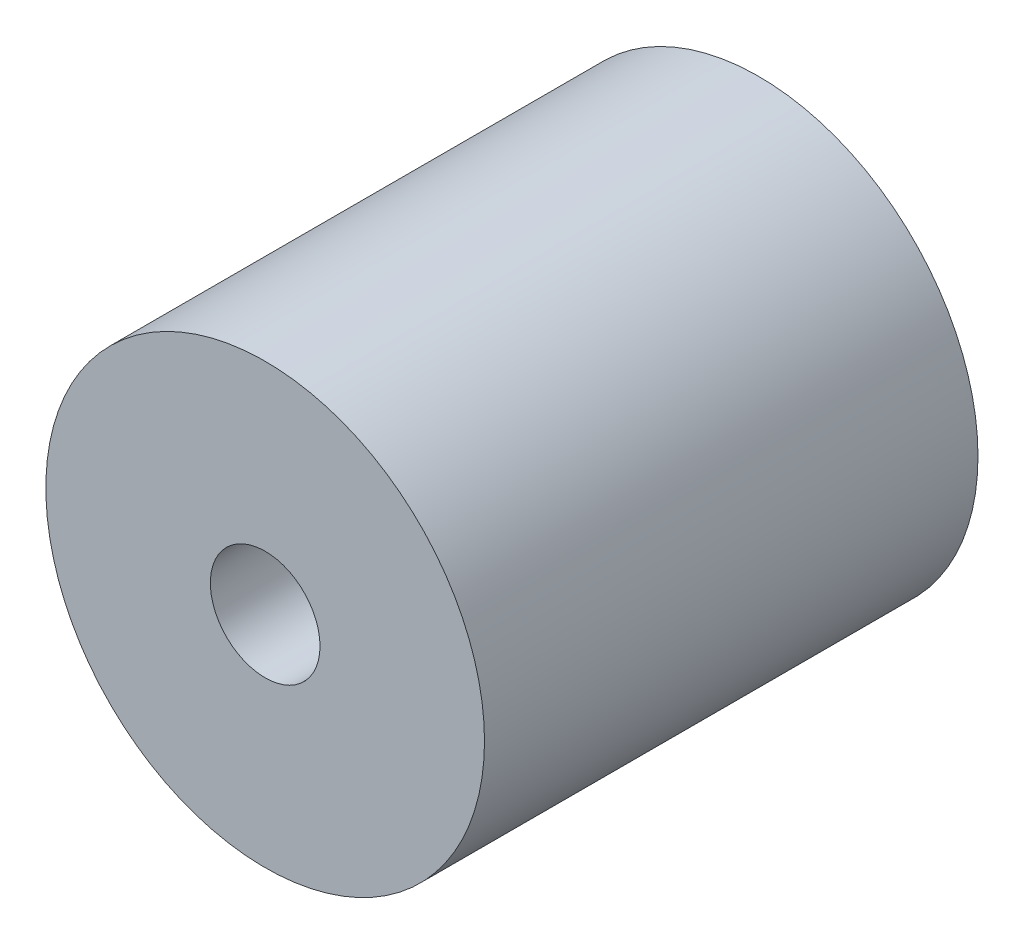
ISO-10303-21;
HEADER;
FILE_DESCRIPTION(('STEP AP214'),'2;1');
FILE_NAME('part.step','',(''),(''),'','','');
FILE_SCHEMA(('AUTOMOTIVE_DESIGN { 1 0 10303 214 1 1 1 1 }'));
ENDSEC;
DATA;
#1=APPLICATION_CONTEXT('core data for automotive mechanical design processes');
#2=APPLICATION_PROTOCOL_DEFINITION('international standard','automotive_design',2000,#1);
#3=PRODUCT_CONTEXT('',#1,'mechanical');
#4=PRODUCT('Part','Part','',(#3));
#5=PRODUCT_RELATED_PRODUCT_CATEGORY('part','',(#4));
#6=PRODUCT_DEFINITION_FORMATION('','',#4);
#7=PRODUCT_DEFINITION_CONTEXT('part definition',#1,'design');
#8=PRODUCT_DEFINITION('design','',#6,#7);
#9=PRODUCT_DEFINITION_SHAPE('','',#8);
#10=(LENGTH_UNIT() NAMED_UNIT(*) SI_UNIT(.MILLI.,.METRE.));
#11=(NAMED_UNIT(*) PLANE_ANGLE_UNIT() SI_UNIT($,.RADIAN.));
#12=(NAMED_UNIT(*) SI_UNIT($,.STERADIAN.) SOLID_ANGLE_UNIT());
#13=UNCERTAINTY_MEASURE_WITH_UNIT(LENGTH_MEASURE(1.E-05),#10,'distance_accuracy_value','');
#14=(GEOMETRIC_REPRESENTATION_CONTEXT(3) GLOBAL_UNCERTAINTY_ASSIGNED_CONTEXT((#13)) GLOBAL_UNIT_ASSIGNED_CONTEXT((#10,
#11,#12)) REPRESENTATION_CONTEXT('',''));
#15=CARTESIAN_POINT('',(0.,0.,0.));
#16=DIRECTION('',(0.,0.,1.));
#17=DIRECTION('',(1.,0.,0.));
#18=AXIS2_PLACEMENT_3D('',#15,#16,#17);
#19=CARTESIAN_POINT('',(0.,0.,90.));
#20=DIRECTION('',(0.,0.,1.));
#21=DIRECTION('',(1.,0.,0.));
#22=AXIS2_PLACEMENT_3D('',#19,#20,#21);
#23=PLANE('',#22);
#24=CARTESIAN_POINT('',(0.,0.,90.));
#25=DIRECTION('',(0.,0.,1.));
#26=DIRECTION('',(1.,0.,0.));
#27=AXIS2_PLACEMENT_3D('',#24,#25,#26);
#28=CIRCLE('',#27,40.);
#29=CARTESIAN_POINT('',(40.,0.,90.));
#30=VERTEX_POINT('',#29);
#31=EDGE_CURVE('E10',#30,#30,#28,.T.);
#32=ORIENTED_EDGE('',*,*,#31,.T.);
#33=EDGE_LOOP('',(#32));
#34=FACE_BOUND('',#33,.T.);
#35=CARTESIAN_POINT('',(0.,0.,90.));
#36=DIRECTION('',(0.,0.,1.));
#37=DIRECTION('',(1.,0.,0.));
#38=AXIS2_PLACEMENT_3D('',#35,#36,#37);
#39=CIRCLE('',#38,10.);
#40=CARTESIAN_POINT('',(10.,0.,90.));
#41=VERTEX_POINT('',#40);
#42=EDGE_CURVE('E46',#41,#41,#39,.T.);
#43=ORIENTED_EDGE('',*,*,#42,.F.);
#44=EDGE_LOOP('',(#43));
#45=FACE_BOUND('',#44,.T.);
#46=ADVANCED_FACE('F35',(#34,#45),#23,.T.);
#47=CARTESIAN_POINT('',(0.,0.,0.));
#48=DIRECTION('',(0.,0.,1.));
#49=DIRECTION('',(1.,0.,0.));
#50=AXIS2_PLACEMENT_3D('',#47,#48,#49);
#51=PLANE('',#50);
#52=CARTESIAN_POINT('',(0.,0.,0.));
#53=DIRECTION('',(0.,0.,1.));
#54=DIRECTION('',(1.,0.,0.));
#55=AXIS2_PLACEMENT_3D('',#52,#53,#54);
#56=CIRCLE('',#55,40.);
#57=CARTESIAN_POINT('',(40.,0.,0.));
#58=VERTEX_POINT('',#57);
#59=EDGE_CURVE('E39',#58,#58,#56,.T.);
#60=ORIENTED_EDGE('',*,*,#59,.F.);
#61=EDGE_LOOP('',(#60));
#62=FACE_BOUND('',#61,.T.);
#63=CARTESIAN_POINT('',(0.,0.,0.));
#64=DIRECTION('',(0.,0.,1.));
#65=DIRECTION('',(1.,0.,0.));
#66=AXIS2_PLACEMENT_3D('',#63,#64,#65);
#67=CIRCLE('',#66,10.);
#68=CARTESIAN_POINT('',(10.,0.,0.));
#69=VERTEX_POINT('',#68);
#70=EDGE_CURVE('E48',#69,#69,#67,.T.);
#71=ORIENTED_EDGE('',*,*,#70,.T.);
#72=EDGE_LOOP('',(#71));
#73=FACE_BOUND('',#72,.T.);
#74=ADVANCED_FACE('F58',(#62,#73),#51,.F.);
#75=CARTESIAN_POINT('',(0.,0.,90.));
#76=DIRECTION('',(0.,0.,-1.));
#77=DIRECTION('',(-1.,0.,0.));
#78=AXIS2_PLACEMENT_3D('',#75,#76,#77);
#79=CYLINDRICAL_SURFACE('',#78,40.);
#80=ORIENTED_EDGE('',*,*,#31,.F.);
#81=EDGE_LOOP('',(#80));
#82=FACE_BOUND('',#81,.T.);
#83=ORIENTED_EDGE('',*,*,#59,.T.);
#84=EDGE_LOOP('',(#83));
#85=FACE_BOUND('',#84,.T.);
#86=ADVANCED_FACE('F37',(#82,#85),#79,.T.);
#87=CARTESIAN_POINT('',(0.,0.,90.));
#88=DIRECTION('',(0.,0.,-1.));
#89=DIRECTION('',(-1.,0.,0.));
#90=AXIS2_PLACEMENT_3D('',#87,#88,#89);
#91=CYLINDRICAL_SURFACE('',#90,10.);
#92=ORIENTED_EDGE('',*,*,#42,.T.);
#93=EDGE_LOOP('',(#92));
#94=FACE_BOUND('',#93,.T.);
#95=ORIENTED_EDGE('',*,*,#70,.F.);
#96=EDGE_LOOP('',(#95));
#97=FACE_BOUND('',#96,.T.);
#98=ADVANCED_FACE('F54',(#94,#97),#91,.F.);
#99=CLOSED_SHELL('',(#46,#74,#86,#98));
#100=MANIFOLD_SOLID_BREP('B2',#99);
#101=ADVANCED_BREP_SHAPE_REPRESENTATION('',(#18,#100),#14);
#102=SHAPE_DEFINITION_REPRESENTATION(#9,#101);
ENDSEC;
END-ISO-10303-21;
